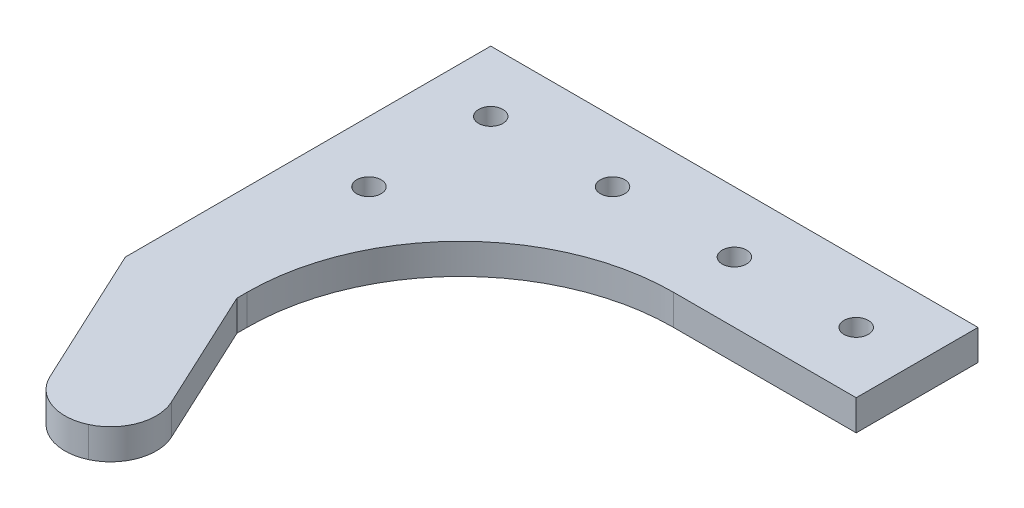
ISO-10303-21;
HEADER;
FILE_DESCRIPTION(('STEP AP214'),'2;1');
FILE_NAME('part.step','',(''),(''),'','','');
FILE_SCHEMA(('AUTOMOTIVE_DESIGN { 1 0 10303 214 1 1 1 1 }'));
ENDSEC;
DATA;
#1=APPLICATION_CONTEXT('core data for automotive mechanical design processes');
#2=APPLICATION_PROTOCOL_DEFINITION('international standard','automotive_design',2000,#1);
#3=PRODUCT_CONTEXT('',#1,'mechanical');
#4=PRODUCT('Part','Part','',(#3));
#5=PRODUCT_RELATED_PRODUCT_CATEGORY('part','',(#4));
#6=PRODUCT_DEFINITION_FORMATION('','',#4);
#7=PRODUCT_DEFINITION_CONTEXT('part definition',#1,'design');
#8=PRODUCT_DEFINITION('design','',#6,#7);
#9=PRODUCT_DEFINITION_SHAPE('','',#8);
#10=(LENGTH_UNIT() NAMED_UNIT(*) SI_UNIT(.MILLI.,.METRE.));
#11=(NAMED_UNIT(*) PLANE_ANGLE_UNIT() SI_UNIT($,.RADIAN.));
#12=(NAMED_UNIT(*) SI_UNIT($,.STERADIAN.) SOLID_ANGLE_UNIT());
#13=UNCERTAINTY_MEASURE_WITH_UNIT(LENGTH_MEASURE(1.E-05),#10,'distance_accuracy_value','');
#14=(GEOMETRIC_REPRESENTATION_CONTEXT(3) GLOBAL_UNCERTAINTY_ASSIGNED_CONTEXT((#13)) GLOBAL_UNIT_ASSIGNED_CONTEXT((#10,
#11,#12)) REPRESENTATION_CONTEXT('',''));
#15=CARTESIAN_POINT('',(0.,0.,0.));
#16=DIRECTION('',(0.,0.,1.));
#17=DIRECTION('',(1.,0.,0.));
#18=AXIS2_PLACEMENT_3D('',#15,#16,#17);
#19=CARTESIAN_POINT('',(0.,6.35,0.));
#20=DIRECTION('',(0.,0.,1.));
#21=DIRECTION('',(1.,0.,0.));
#22=AXIS2_PLACEMENT_3D('',#19,#20,#21);
#23=PLANE('',#22);
#24=DIRECTION('',(-1.,0.,0.));
#25=VECTOR('',#24,1.);
#26=CARTESIAN_POINT('',(0.,0.,0.));
#27=LINE('',#26,#25);
#28=CARTESIAN_POINT('',(101.6,0.,0.));
#29=VERTEX_POINT('',#28);
#30=CARTESIAN_POINT('',(0.,0.,0.));
#31=VERTEX_POINT('',#30);
#32=EDGE_CURVE('E131',#29,#31,#27,.T.);
#33=ORIENTED_EDGE('',*,*,#32,.T.);
#34=DIRECTION('',(0.,-1.,0.));
#35=VECTOR('',#34,1.);
#36=CARTESIAN_POINT('',(0.,6.35,0.));
#37=LINE('',#36,#35);
#38=CARTESIAN_POINT('',(0.,6.35,0.));
#39=VERTEX_POINT('',#38);
#40=EDGE_CURVE('E113',#39,#31,#37,.T.);
#41=ORIENTED_EDGE('',*,*,#40,.F.);
#42=DIRECTION('',(-1.,0.,0.));
#43=VECTOR('',#42,1.);
#44=CARTESIAN_POINT('',(0.,6.35,0.));
#45=LINE('',#44,#43);
#46=CARTESIAN_POINT('',(101.6,6.35,0.));
#47=VERTEX_POINT('',#46);
#48=EDGE_CURVE('E119',#47,#39,#45,.T.);
#49=ORIENTED_EDGE('',*,*,#48,.F.);
#50=DIRECTION('',(0.,-1.,0.));
#51=VECTOR('',#50,1.);
#52=CARTESIAN_POINT('',(101.6,6.35,0.));
#53=LINE('',#52,#51);
#54=EDGE_CURVE('E164',#47,#29,#53,.T.);
#55=ORIENTED_EDGE('',*,*,#54,.T.);
#56=EDGE_LOOP('',(#33,#41,#49,#55));
#57=FACE_BOUND('',#56,.T.);
#58=ADVANCED_FACE('F35',(#57),#23,.F.);
#59=CARTESIAN_POINT('',(0.,6.35,0.));
#60=DIRECTION('',(1.,0.,0.));
#61=DIRECTION('',(0.,0.,-1.));
#62=AXIS2_PLACEMENT_3D('',#59,#60,#61);
#63=PLANE('',#62);
#64=DIRECTION('',(0.,0.,1.));
#65=VECTOR('',#64,1.);
#66=CARTESIAN_POINT('',(0.,0.,0.));
#67=LINE('',#66,#65);
#68=CARTESIAN_POINT('',(0.,0.,76.2));
#69=VERTEX_POINT('',#68);
#70=EDGE_CURVE('E166',#31,#69,#67,.T.);
#71=ORIENTED_EDGE('',*,*,#70,.T.);
#72=DIRECTION('',(0.,-1.,0.));
#73=VECTOR('',#72,1.);
#74=CARTESIAN_POINT('',(0.,6.35,76.2));
#75=LINE('',#74,#73);
#76=CARTESIAN_POINT('',(0.,6.35,76.2));
#77=VERTEX_POINT('',#76);
#78=EDGE_CURVE('E116',#77,#69,#75,.T.);
#79=ORIENTED_EDGE('',*,*,#78,.F.);
#80=DIRECTION('',(0.,0.,1.));
#81=VECTOR('',#80,1.);
#82=CARTESIAN_POINT('',(0.,6.35,0.));
#83=LINE('',#82,#81);
#84=EDGE_CURVE('E109',#39,#77,#83,.T.);
#85=ORIENTED_EDGE('',*,*,#84,.F.);
#86=ORIENTED_EDGE('',*,*,#40,.T.);
#87=EDGE_LOOP('',(#71,#79,#85,#86));
#88=FACE_BOUND('',#87,.T.);
#89=ADVANCED_FACE('F111',(#88),#63,.F.);
#90=CARTESIAN_POINT('',(0.,6.35,76.2));
#91=DIRECTION('',(0.906307787036649,0.,-0.422618261740701));
#92=DIRECTION('',(-0.422618261740701,0.,-0.906307787036649));
#93=AXIS2_PLACEMENT_3D('',#90,#91,#92);
#94=PLANE('',#93);
#95=DIRECTION('',(0.422618261740701,0.,0.906307787036649));
#96=VECTOR('',#95,1.);
#97=CARTESIAN_POINT('',(0.,0.,76.2));
#98=LINE('',#97,#96);
#99=CARTESIAN_POINT('',(13.7408828326253,0.,105.667418328476));
#100=VERTEX_POINT('',#99);
#101=EDGE_CURVE('E150',#69,#100,#98,.T.);
#102=ORIENTED_EDGE('',*,*,#101,.T.);
#103=DIRECTION('',(0.,-1.,0.));
#104=VECTOR('',#103,1.);
#105=CARTESIAN_POINT('',(13.7408828326253,6.35,105.667418328476));
#106=LINE('',#105,#104);
#107=CARTESIAN_POINT('',(13.7408828326253,6.35,105.667418328476));
#108=VERTEX_POINT('',#107);
#109=EDGE_CURVE('E141',#100,#108,#106,.F.);
#110=ORIENTED_EDGE('',*,*,#109,.T.);
#111=DIRECTION('',(0.422618261740701,0.,0.906307787036649));
#112=VECTOR('',#111,1.);
#113=CARTESIAN_POINT('',(0.,6.35,76.2));
#114=LINE('',#113,#112);
#115=EDGE_CURVE('E118',#77,#108,#114,.T.);
#116=ORIENTED_EDGE('',*,*,#115,.F.);
#117=ORIENTED_EDGE('',*,*,#78,.T.);
#118=EDGE_LOOP('',(#102,#110,#116,#117));
#119=FACE_BOUND('',#118,.T.);
#120=ADVANCED_FACE('F148',(#119),#94,.F.);
#121=CARTESIAN_POINT('',(35.0314851187537,6.35,106.24912211384));
#122=DIRECTION('',(-0.906307787036649,0.,0.422618261740701));
#123=DIRECTION('',(0.422618261740702,0.,0.906307787036649));
#124=AXIS2_PLACEMENT_3D('',#121,#122,#123);
#125=PLANE('',#124);
#126=DIRECTION('',(-0.422618261740701,0.,-0.906307787036649));
#127=VECTOR('',#126,1.);
#128=CARTESIAN_POINT('',(35.0314851187537,6.35,106.24912211384));
#129=LINE('',#128,#127);
#130=CARTESIAN_POINT('',(31.0060461756735,6.35,97.6165404423156));
#131=VERTEX_POINT('',#130);
#132=CARTESIAN_POINT('',(19.05,6.35,71.976716676652));
#133=VERTEX_POINT('',#132);
#134=EDGE_CURVE('E153',#131,#133,#129,.T.);
#135=ORIENTED_EDGE('',*,*,#134,.F.);
#136=DIRECTION('',(0.,-1.,0.));
#137=VECTOR('',#136,1.);
#138=CARTESIAN_POINT('',(31.0060461756735,6.35,97.6165404423156));
#139=LINE('',#138,#137);
#140=CARTESIAN_POINT('',(31.0060461756735,0.,97.6165404423156));
#141=VERTEX_POINT('',#140);
#142=EDGE_CURVE('E11',#131,#141,#139,.T.);
#143=ORIENTED_EDGE('',*,*,#142,.T.);
#144=DIRECTION('',(-0.422618261740701,0.,-0.906307787036649));
#145=VECTOR('',#144,1.);
#146=CARTESIAN_POINT('',(35.0314851187537,0.,106.24912211384));
#147=LINE('',#146,#145);
#148=CARTESIAN_POINT('',(19.05,0.,71.976716676652));
#149=VERTEX_POINT('',#148);
#150=EDGE_CURVE('E170',#141,#149,#147,.T.);
#151=ORIENTED_EDGE('',*,*,#150,.T.);
#152=DIRECTION('',(0.,-1.,0.));
#153=VECTOR('',#152,1.);
#154=CARTESIAN_POINT('',(19.05,6.35,71.976716676652));
#155=LINE('',#154,#153);
#156=EDGE_CURVE('E136',#133,#149,#155,.T.);
#157=ORIENTED_EDGE('',*,*,#156,.F.);
#158=EDGE_LOOP('',(#135,#143,#151,#157));
#159=FACE_BOUND('',#158,.T.);
#160=ADVANCED_FACE('F212',(#159),#125,.F.);
#161=CARTESIAN_POINT('',(19.05,6.35,71.976716676652));
#162=DIRECTION('',(-1.,0.,0.));
#163=DIRECTION('',(0.,0.,1.));
#164=AXIS2_PLACEMENT_3D('',#161,#162,#163);
#165=PLANE('',#164);
#166=DIRECTION('',(0.,0.,-1.));
#167=VECTOR('',#166,1.);
#168=CARTESIAN_POINT('',(19.05,0.,71.976716676652));
#169=LINE('',#168,#167);
#170=CARTESIAN_POINT('',(19.05,0.,69.85));
#171=VERTEX_POINT('',#170);
#172=EDGE_CURVE('E172',#149,#171,#169,.T.);
#173=ORIENTED_EDGE('',*,*,#172,.T.);
#174=DIRECTION('',(0.,-1.,0.));
#175=VECTOR('',#174,1.);
#176=CARTESIAN_POINT('',(19.05,6.35,69.85));
#177=LINE('',#176,#175);
#178=CARTESIAN_POINT('',(19.05,6.35,69.85));
#179=VERTEX_POINT('',#178);
#180=EDGE_CURVE('E186',#179,#171,#177,.T.);
#181=ORIENTED_EDGE('',*,*,#180,.F.);
#182=DIRECTION('',(0.,0.,-1.));
#183=VECTOR('',#182,1.);
#184=CARTESIAN_POINT('',(19.05,6.35,71.976716676652));
#185=LINE('',#184,#183);
#186=EDGE_CURVE('E155',#133,#179,#185,.T.);
#187=ORIENTED_EDGE('',*,*,#186,.F.);
#188=ORIENTED_EDGE('',*,*,#156,.T.);
#189=EDGE_LOOP('',(#173,#181,#187,#188));
#190=FACE_BOUND('',#189,.T.);
#191=ADVANCED_FACE('F193',(#190),#165,.F.);
#192=CARTESIAN_POINT('',(63.5,6.35,69.85));
#193=DIRECTION('',(0.,-1.,0.));
#194=DIRECTION('',(0.,0.,-1.));
#195=AXIS2_PLACEMENT_3D('',#192,#193,#194);
#196=CYLINDRICAL_SURFACE('',#195,44.45);
#197=CARTESIAN_POINT('',(63.5,0.,69.85));
#198=DIRECTION('',(0.,-1.,0.));
#199=DIRECTION('',(0.,0.,-1.));
#200=AXIS2_PLACEMENT_3D('',#197,#198,#199);
#201=CIRCLE('',#200,44.45);
#202=CARTESIAN_POINT('',(63.5,0.,25.4));
#203=VERTEX_POINT('',#202);
#204=EDGE_CURVE('E174',#171,#203,#201,.T.);
#205=ORIENTED_EDGE('',*,*,#204,.T.);
#206=DIRECTION('',(0.,-1.,0.));
#207=VECTOR('',#206,1.);
#208=CARTESIAN_POINT('',(63.5,6.35,25.4));
#209=LINE('',#208,#207);
#210=CARTESIAN_POINT('',(63.5,6.35,25.4));
#211=VERTEX_POINT('',#210);
#212=EDGE_CURVE('E183',#211,#203,#209,.T.);
#213=ORIENTED_EDGE('',*,*,#212,.F.);
#214=CARTESIAN_POINT('',(63.5,6.35,69.85));
#215=DIRECTION('',(0.,-1.,0.));
#216=DIRECTION('',(0.,0.,-1.));
#217=AXIS2_PLACEMENT_3D('',#214,#215,#216);
#218=CIRCLE('',#217,44.45);
#219=EDGE_CURVE('E159',#179,#211,#218,.T.);
#220=ORIENTED_EDGE('',*,*,#219,.F.);
#221=ORIENTED_EDGE('',*,*,#180,.T.);
#222=EDGE_LOOP('',(#205,#213,#220,#221));
#223=FACE_BOUND('',#222,.T.);
#224=ADVANCED_FACE('F205',(#223),#196,.F.);
#225=CARTESIAN_POINT('',(63.5,6.35,25.4));
#226=DIRECTION('',(0.,0.,-1.));
#227=DIRECTION('',(-1.,0.,0.));
#228=AXIS2_PLACEMENT_3D('',#225,#226,#227);
#229=PLANE('',#228);
#230=DIRECTION('',(1.,0.,0.));
#231=VECTOR('',#230,1.);
#232=CARTESIAN_POINT('',(63.5,0.,25.4));
#233=LINE('',#232,#231);
#234=CARTESIAN_POINT('',(101.6,0.,25.4));
#235=VERTEX_POINT('',#234);
#236=EDGE_CURVE('E176',#203,#235,#233,.T.);
#237=ORIENTED_EDGE('',*,*,#236,.T.);
#238=DIRECTION('',(0.,-1.,0.));
#239=VECTOR('',#238,1.);
#240=CARTESIAN_POINT('',(101.6,6.35,25.4));
#241=LINE('',#240,#239);
#242=CARTESIAN_POINT('',(101.6,6.35,25.4));
#243=VERTEX_POINT('',#242);
#244=EDGE_CURVE('E180',#243,#235,#241,.T.);
#245=ORIENTED_EDGE('',*,*,#244,.F.);
#246=DIRECTION('',(1.,0.,0.));
#247=VECTOR('',#246,1.);
#248=CARTESIAN_POINT('',(63.5,6.35,25.4));
#249=LINE('',#248,#247);
#250=EDGE_CURVE('E161',#211,#243,#249,.T.);
#251=ORIENTED_EDGE('',*,*,#250,.F.);
#252=ORIENTED_EDGE('',*,*,#212,.T.);
#253=EDGE_LOOP('',(#237,#245,#251,#252));
#254=FACE_BOUND('',#253,.T.);
#255=ADVANCED_FACE('F209',(#254),#229,.F.);
#256=CARTESIAN_POINT('',(101.6,6.35,25.4));
#257=DIRECTION('',(-1.,0.,0.));
#258=DIRECTION('',(0.,0.,1.));
#259=AXIS2_PLACEMENT_3D('',#256,#257,#258);
#260=PLANE('',#259);
#261=DIRECTION('',(0.,0.,-1.));
#262=VECTOR('',#261,1.);
#263=CARTESIAN_POINT('',(101.6,0.,25.4));
#264=LINE('',#263,#262);
#265=EDGE_CURVE('E128',#235,#29,#264,.T.);
#266=ORIENTED_EDGE('',*,*,#265,.T.);
#267=ORIENTED_EDGE('',*,*,#54,.F.);
#268=DIRECTION('',(0.,0.,-1.));
#269=VECTOR('',#268,1.);
#270=CARTESIAN_POINT('',(101.6,6.35,25.4));
#271=LINE('',#270,#269);
#272=EDGE_CURVE('E124',#243,#47,#271,.T.);
#273=ORIENTED_EDGE('',*,*,#272,.F.);
#274=ORIENTED_EDGE('',*,*,#244,.T.);
#275=EDGE_LOOP('',(#266,#267,#273,#274));
#276=FACE_BOUND('',#275,.T.);
#277=ADVANCED_FACE('F253',(#276),#260,.F.);
#278=CARTESIAN_POINT('',(63.5,6.35,69.85));
#279=DIRECTION('',(0.,-1.,0.));
#280=DIRECTION('',(0.,0.,-1.));
#281=AXIS2_PLACEMENT_3D('',#278,#279,#280);
#282=PLANE('',#281);
#283=CARTESIAN_POINT('',(12.7,6.35,38.1));
#284=DIRECTION('',(0.,1.,0.));
#285=DIRECTION('',(0.,0.,1.));
#286=AXIS2_PLACEMENT_3D('',#283,#284,#285);
#287=CIRCLE('',#286,2.54);
#288=CARTESIAN_POINT('',(12.7,6.35,40.64));
#289=VERTEX_POINT('',#288);
#290=EDGE_CURVE('E217',#289,#289,#287,.T.);
#291=ORIENTED_EDGE('',*,*,#290,.F.);
#292=EDGE_LOOP('',(#291));
#293=FACE_BOUND('',#292,.T.);
#294=CARTESIAN_POINT('',(88.9,6.35,12.7));
#295=DIRECTION('',(0.,1.,0.));
#296=DIRECTION('',(0.,0.,1.));
#297=AXIS2_PLACEMENT_3D('',#294,#295,#296);
#298=CIRCLE('',#297,2.54);
#299=CARTESIAN_POINT('',(88.9,6.35,15.24));
#300=VERTEX_POINT('',#299);
#301=EDGE_CURVE('E224',#300,#300,#298,.T.);
#302=ORIENTED_EDGE('',*,*,#301,.F.);
#303=EDGE_LOOP('',(#302));
#304=FACE_BOUND('',#303,.T.);
#305=CARTESIAN_POINT('',(63.5,6.35,12.7));
#306=DIRECTION('',(0.,1.,0.));
#307=DIRECTION('',(0.,0.,1.));
#308=AXIS2_PLACEMENT_3D('',#305,#306,#307);
#309=CIRCLE('',#308,2.54);
#310=CARTESIAN_POINT('',(63.5,6.35,15.24));
#311=VERTEX_POINT('',#310);
#312=EDGE_CURVE('E230',#311,#311,#309,.T.);
#313=ORIENTED_EDGE('',*,*,#312,.F.);
#314=EDGE_LOOP('',(#313));
#315=FACE_BOUND('',#314,.T.);
#316=CARTESIAN_POINT('',(38.1,6.35,12.7));
#317=DIRECTION('',(0.,1.,0.));
#318=DIRECTION('',(0.,0.,1.));
#319=AXIS2_PLACEMENT_3D('',#316,#317,#318);
#320=CIRCLE('',#319,2.54);
#321=CARTESIAN_POINT('',(38.1,6.35,15.24));
#322=VERTEX_POINT('',#321);
#323=EDGE_CURVE('E236',#322,#322,#320,.T.);
#324=ORIENTED_EDGE('',*,*,#323,.F.);
#325=EDGE_LOOP('',(#324));
#326=FACE_BOUND('',#325,.T.);
#327=CARTESIAN_POINT('',(12.7,6.35,12.7));
#328=DIRECTION('',(0.,1.,0.));
#329=DIRECTION('',(0.,0.,1.));
#330=AXIS2_PLACEMENT_3D('',#327,#328,#329);
#331=CIRCLE('',#330,2.54);
#332=CARTESIAN_POINT('',(12.7,6.35,15.24));
#333=VERTEX_POINT('',#332);
#334=EDGE_CURVE('E242',#333,#333,#331,.T.);
#335=ORIENTED_EDGE('',*,*,#334,.F.);
#336=EDGE_LOOP('',(#335));
#337=FACE_BOUND('',#336,.T.);
#338=ORIENTED_EDGE('',*,*,#115,.T.);
#339=CARTESIAN_POINT('',(22.3734645041494,6.35,101.641979385396));
#340=DIRECTION('',(0.,-1.,0.));
#341=DIRECTION('',(0.,0.,-1.));
#342=AXIS2_PLACEMENT_3D('',#339,#340,#341);
#343=CIRCLE('',#342,9.525);
#344=CARTESIAN_POINT('',(26.3989034472296,6.35,110.27456105692));
#345=VERTEX_POINT('',#344);
#346=EDGE_CURVE('E44',#108,#345,#343,.F.);
#347=ORIENTED_EDGE('',*,*,#346,.T.);
#348=CARTESIAN_POINT('',(22.3734645041494,6.35,101.641979385396));
#349=DIRECTION('',(0.,-1.,0.));
#350=DIRECTION('',(0.,0.,-1.));
#351=AXIS2_PLACEMENT_3D('',#348,#349,#350);
#352=CIRCLE('',#351,9.525);
#353=EDGE_CURVE('E51',#345,#131,#352,.F.);
#354=ORIENTED_EDGE('',*,*,#353,.T.);
#355=ORIENTED_EDGE('',*,*,#134,.T.);
#356=ORIENTED_EDGE('',*,*,#186,.T.);
#357=ORIENTED_EDGE('',*,*,#219,.T.);
#358=ORIENTED_EDGE('',*,*,#250,.T.);
#359=ORIENTED_EDGE('',*,*,#272,.T.);
#360=ORIENTED_EDGE('',*,*,#48,.T.);
#361=ORIENTED_EDGE('',*,*,#84,.T.);
#362=EDGE_LOOP('',(#338,#347,#354,#355,#356,#357,#358,#359,#360,#361));
#363=FACE_BOUND('',#362,.T.);
#364=ADVANCED_FACE('F122',(#293,#304,#315,#326,#337,#363),#282,.F.);
#365=CARTESIAN_POINT('',(63.5,0.,69.85));
#366=DIRECTION('',(0.,-1.,0.));
#367=DIRECTION('',(0.,0.,-1.));
#368=AXIS2_PLACEMENT_3D('',#365,#366,#367);
#369=PLANE('',#368);
#370=CARTESIAN_POINT('',(12.7,0.,38.1));
#371=DIRECTION('',(0.,1.,0.));
#372=DIRECTION('',(0.,0.,1.));
#373=AXIS2_PLACEMENT_3D('',#370,#371,#372);
#374=CIRCLE('',#373,2.54);
#375=CARTESIAN_POINT('',(12.7,0.,40.64));
#376=VERTEX_POINT('',#375);
#377=EDGE_CURVE('E219',#376,#376,#374,.T.);
#378=ORIENTED_EDGE('',*,*,#377,.T.);
#379=EDGE_LOOP('',(#378));
#380=FACE_BOUND('',#379,.T.);
#381=CARTESIAN_POINT('',(88.9,0.,12.7));
#382=DIRECTION('',(0.,1.,0.));
#383=DIRECTION('',(0.,0.,1.));
#384=AXIS2_PLACEMENT_3D('',#381,#382,#383);
#385=CIRCLE('',#384,2.54);
#386=CARTESIAN_POINT('',(88.9,0.,15.24));
#387=VERTEX_POINT('',#386);
#388=EDGE_CURVE('E227',#387,#387,#385,.T.);
#389=ORIENTED_EDGE('',*,*,#388,.T.);
#390=EDGE_LOOP('',(#389));
#391=FACE_BOUND('',#390,.T.);
#392=CARTESIAN_POINT('',(63.5,0.,12.7));
#393=DIRECTION('',(0.,1.,0.));
#394=DIRECTION('',(0.,0.,1.));
#395=AXIS2_PLACEMENT_3D('',#392,#393,#394);
#396=CIRCLE('',#395,2.54);
#397=CARTESIAN_POINT('',(63.5,0.,15.24));
#398=VERTEX_POINT('',#397);
#399=EDGE_CURVE('E233',#398,#398,#396,.T.);
#400=ORIENTED_EDGE('',*,*,#399,.T.);
#401=EDGE_LOOP('',(#400));
#402=FACE_BOUND('',#401,.T.);
#403=CARTESIAN_POINT('',(38.1,0.,12.7));
#404=DIRECTION('',(0.,1.,0.));
#405=DIRECTION('',(0.,0.,1.));
#406=AXIS2_PLACEMENT_3D('',#403,#404,#405);
#407=CIRCLE('',#406,2.54);
#408=CARTESIAN_POINT('',(38.1,0.,15.24));
#409=VERTEX_POINT('',#408);
#410=EDGE_CURVE('E239',#409,#409,#407,.T.);
#411=ORIENTED_EDGE('',*,*,#410,.T.);
#412=EDGE_LOOP('',(#411));
#413=FACE_BOUND('',#412,.T.);
#414=CARTESIAN_POINT('',(12.7,0.,12.7));
#415=DIRECTION('',(0.,1.,0.));
#416=DIRECTION('',(0.,0.,1.));
#417=AXIS2_PLACEMENT_3D('',#414,#415,#416);
#418=CIRCLE('',#417,2.54);
#419=CARTESIAN_POINT('',(12.7,0.,15.24));
#420=VERTEX_POINT('',#419);
#421=EDGE_CURVE('E167',#420,#420,#418,.T.);
#422=ORIENTED_EDGE('',*,*,#421,.T.);
#423=EDGE_LOOP('',(#422));
#424=FACE_BOUND('',#423,.T.);
#425=CARTESIAN_POINT('',(22.3734645041494,0.,101.641979385396));
#426=DIRECTION('',(0.,-1.,0.));
#427=DIRECTION('',(0.,0.,-1.));
#428=AXIS2_PLACEMENT_3D('',#425,#426,#427);
#429=CIRCLE('',#428,9.525);
#430=CARTESIAN_POINT('',(26.3989034472296,0.,110.27456105692));
#431=VERTEX_POINT('',#430);
#432=EDGE_CURVE('E132',#141,#431,#429,.T.);
#433=ORIENTED_EDGE('',*,*,#432,.T.);
#434=CARTESIAN_POINT('',(22.3734645041494,0.,101.641979385396));
#435=DIRECTION('',(0.,-1.,0.));
#436=DIRECTION('',(0.,0.,-1.));
#437=AXIS2_PLACEMENT_3D('',#434,#435,#436);
#438=CIRCLE('',#437,9.525);
#439=EDGE_CURVE('E134',#431,#100,#438,.T.);
#440=ORIENTED_EDGE('',*,*,#439,.T.);
#441=ORIENTED_EDGE('',*,*,#101,.F.);
#442=ORIENTED_EDGE('',*,*,#70,.F.);
#443=ORIENTED_EDGE('',*,*,#32,.F.);
#444=ORIENTED_EDGE('',*,*,#265,.F.);
#445=ORIENTED_EDGE('',*,*,#236,.F.);
#446=ORIENTED_EDGE('',*,*,#204,.F.);
#447=ORIENTED_EDGE('',*,*,#172,.F.);
#448=ORIENTED_EDGE('',*,*,#150,.F.);
#449=EDGE_LOOP('',(#433,#440,#441,#442,#443,#444,#445,#446,#447,#448));
#450=FACE_BOUND('',#449,.T.);
#451=ADVANCED_FACE('F199',(#380,#391,#402,#413,#424,#450),#369,.T.);
#452=CARTESIAN_POINT('',(12.7,0.,12.7));
#453=DIRECTION('',(0.,1.,0.));
#454=DIRECTION('',(0.,0.,1.));
#455=AXIS2_PLACEMENT_3D('',#452,#453,#454);
#456=CYLINDRICAL_SURFACE('',#455,2.54);
#457=ORIENTED_EDGE('',*,*,#421,.F.);
#458=EDGE_LOOP('',(#457));
#459=FACE_BOUND('',#458,.T.);
#460=ORIENTED_EDGE('',*,*,#334,.T.);
#461=EDGE_LOOP('',(#460));
#462=FACE_BOUND('',#461,.T.);
#463=ADVANCED_FACE('F250',(#459,#462),#456,.F.);
#464=CARTESIAN_POINT('',(38.1,0.,12.7));
#465=DIRECTION('',(0.,1.,0.));
#466=DIRECTION('',(0.,0.,1.));
#467=AXIS2_PLACEMENT_3D('',#464,#465,#466);
#468=CYLINDRICAL_SURFACE('',#467,2.54);
#469=ORIENTED_EDGE('',*,*,#410,.F.);
#470=EDGE_LOOP('',(#469));
#471=FACE_BOUND('',#470,.T.);
#472=ORIENTED_EDGE('',*,*,#323,.T.);
#473=EDGE_LOOP('',(#472));
#474=FACE_BOUND('',#473,.T.);
#475=ADVANCED_FACE('F294',(#471,#474),#468,.F.);
#476=CARTESIAN_POINT('',(63.5,0.,12.7));
#477=DIRECTION('',(0.,1.,0.));
#478=DIRECTION('',(0.,0.,1.));
#479=AXIS2_PLACEMENT_3D('',#476,#477,#478);
#480=CYLINDRICAL_SURFACE('',#479,2.54);
#481=ORIENTED_EDGE('',*,*,#399,.F.);
#482=EDGE_LOOP('',(#481));
#483=FACE_BOUND('',#482,.T.);
#484=ORIENTED_EDGE('',*,*,#312,.T.);
#485=EDGE_LOOP('',(#484));
#486=FACE_BOUND('',#485,.T.);
#487=ADVANCED_FACE('F287',(#483,#486),#480,.F.);
#488=CARTESIAN_POINT('',(88.9,0.,12.7));
#489=DIRECTION('',(0.,1.,0.));
#490=DIRECTION('',(0.,0.,1.));
#491=AXIS2_PLACEMENT_3D('',#488,#489,#490);
#492=CYLINDRICAL_SURFACE('',#491,2.54);
#493=ORIENTED_EDGE('',*,*,#388,.F.);
#494=EDGE_LOOP('',(#493));
#495=FACE_BOUND('',#494,.T.);
#496=ORIENTED_EDGE('',*,*,#301,.T.);
#497=EDGE_LOOP('',(#496));
#498=FACE_BOUND('',#497,.T.);
#499=ADVANCED_FACE('F281',(#495,#498),#492,.F.);
#500=CARTESIAN_POINT('',(12.7,0.,38.1));
#501=DIRECTION('',(0.,1.,0.));
#502=DIRECTION('',(0.,0.,1.));
#503=AXIS2_PLACEMENT_3D('',#500,#501,#502);
#504=CYLINDRICAL_SURFACE('',#503,2.54);
#505=ORIENTED_EDGE('',*,*,#377,.F.);
#506=EDGE_LOOP('',(#505));
#507=FACE_BOUND('',#506,.T.);
#508=ORIENTED_EDGE('',*,*,#290,.T.);
#509=EDGE_LOOP('',(#508));
#510=FACE_BOUND('',#509,.T.);
#511=ADVANCED_FACE('F277',(#507,#510),#504,.F.);
#512=CARTESIAN_POINT('',(22.3734645041494,6.35,101.641979385396));
#513=DIRECTION('',(0.,-1.,0.));
#514=DIRECTION('',(0.,0.,-1.));
#515=AXIS2_PLACEMENT_3D('',#512,#513,#514);
#516=CYLINDRICAL_SURFACE('',#515,9.525);
#517=ORIENTED_EDGE('',*,*,#142,.F.);
#518=ORIENTED_EDGE('',*,*,#353,.F.);
#519=DIRECTION('',(0.,-1.,0.));
#520=VECTOR('',#519,1.);
#521=CARTESIAN_POINT('',(26.3989034472296,6.35,110.27456105692));
#522=LINE('',#521,#520);
#523=EDGE_CURVE('E39',#431,#345,#522,.F.);
#524=ORIENTED_EDGE('',*,*,#523,.F.);
#525=ORIENTED_EDGE('',*,*,#432,.F.);
#526=EDGE_LOOP('',(#517,#518,#524,#525));
#527=FACE_BOUND('',#526,.T.);
#528=ADVANCED_FACE('F37',(#527),#516,.T.);
#529=CARTESIAN_POINT('',(22.3734645041494,6.35,101.641979385396));
#530=DIRECTION('',(0.,-1.,0.));
#531=DIRECTION('',(0.,0.,-1.));
#532=AXIS2_PLACEMENT_3D('',#529,#530,#531);
#533=CYLINDRICAL_SURFACE('',#532,9.525);
#534=ORIENTED_EDGE('',*,*,#346,.F.);
#535=ORIENTED_EDGE('',*,*,#109,.F.);
#536=ORIENTED_EDGE('',*,*,#439,.F.);
#537=ORIENTED_EDGE('',*,*,#523,.T.);
#538=EDGE_LOOP('',(#534,#535,#536,#537));
#539=FACE_BOUND('',#538,.T.);
#540=ADVANCED_FACE('F216',(#539),#533,.T.);
#541=CLOSED_SHELL('',(#58,#89,#120,#160,#191,#224,#255,#277,#364,#451,#463,#475,#487,#499,#511,
#528,#540));
#542=MANIFOLD_SOLID_BREP('B2',#541);
#543=ADVANCED_BREP_SHAPE_REPRESENTATION('',(#18,#542),#14);
#544=SHAPE_DEFINITION_REPRESENTATION(#9,#543);
ENDSEC;
END-ISO-10303-21;
